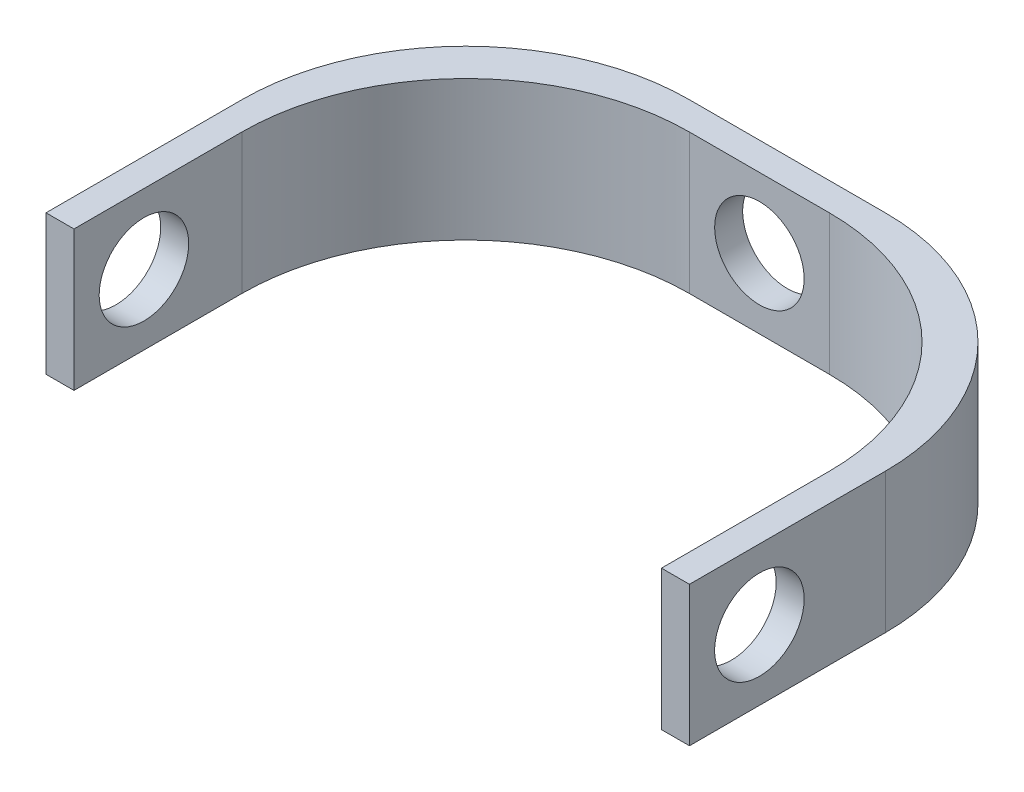
ISO-10303-21;
HEADER;
FILE_DESCRIPTION(('STEP AP214'),'2;1');
FILE_NAME('part.step','',(''),(''),'','','');
FILE_SCHEMA(('AUTOMOTIVE_DESIGN { 1 0 10303 214 1 1 1 1 }'));
ENDSEC;
DATA;
#1=APPLICATION_CONTEXT('core data for automotive mechanical design processes');
#2=APPLICATION_PROTOCOL_DEFINITION('international standard','automotive_design',2000,#1);
#3=PRODUCT_CONTEXT('',#1,'mechanical');
#4=PRODUCT('Part','Part','',(#3));
#5=PRODUCT_RELATED_PRODUCT_CATEGORY('part','',(#4));
#6=PRODUCT_DEFINITION_FORMATION('','',#4);
#7=PRODUCT_DEFINITION_CONTEXT('part definition',#1,'design');
#8=PRODUCT_DEFINITION('design','',#6,#7);
#9=PRODUCT_DEFINITION_SHAPE('','',#8);
#10=(LENGTH_UNIT() NAMED_UNIT(*) SI_UNIT(.MILLI.,.METRE.));
#11=(NAMED_UNIT(*) PLANE_ANGLE_UNIT() SI_UNIT($,.RADIAN.));
#12=(NAMED_UNIT(*) SI_UNIT($,.STERADIAN.) SOLID_ANGLE_UNIT());
#13=UNCERTAINTY_MEASURE_WITH_UNIT(LENGTH_MEASURE(1.E-05),#10,'distance_accuracy_value','');
#14=(GEOMETRIC_REPRESENTATION_CONTEXT(3) GLOBAL_UNCERTAINTY_ASSIGNED_CONTEXT((#13)) GLOBAL_UNIT_ASSIGNED_CONTEXT((#10,
#11,#12)) REPRESENTATION_CONTEXT('',''));
#15=CARTESIAN_POINT('',(0.,0.,0.));
#16=DIRECTION('',(0.,0.,1.));
#17=DIRECTION('',(1.,0.,0.));
#18=AXIS2_PLACEMENT_3D('',#15,#16,#17);
#19=CARTESIAN_POINT('',(0.,5.,0.));
#20=DIRECTION('',(1.,0.,0.));
#21=DIRECTION('',(0.,0.,-1.));
#22=AXIS2_PLACEMENT_3D('',#19,#20,#21);
#23=PLANE('',#22);
#24=CARTESIAN_POINT('',(0.,2.5,-2.5));
#25=DIRECTION('',(1.,0.,0.));
#26=DIRECTION('',(0.,0.,-1.));
#27=AXIS2_PLACEMENT_3D('',#24,#25,#26);
#28=CIRCLE('',#27,1.6);
#29=CARTESIAN_POINT('',(0.,2.5,-4.1));
#30=VERTEX_POINT('',#29);
#31=EDGE_CURVE('E295',#30,#30,#28,.T.);
#32=ORIENTED_EDGE('',*,*,#31,.T.);
#33=EDGE_LOOP('',(#32));
#34=FACE_BOUND('',#33,.T.);
#35=DIRECTION('',(0.,0.,1.));
#36=VECTOR('',#35,1.);
#37=CARTESIAN_POINT('',(0.,5.,0.));
#38=LINE('',#37,#36);
#39=CARTESIAN_POINT('',(0.,5.,-7.));
#40=VERTEX_POINT('',#39);
#41=CARTESIAN_POINT('',(0.,5.,0.));
#42=VERTEX_POINT('',#41);
#43=EDGE_CURVE('E128',#40,#42,#38,.T.);
#44=ORIENTED_EDGE('',*,*,#43,.F.);
#45=DIRECTION('',(0.,-1.,0.));
#46=VECTOR('',#45,1.);
#47=CARTESIAN_POINT('',(0.,5.,-7.));
#48=LINE('',#47,#46);
#49=CARTESIAN_POINT('',(0.,0.,-7.));
#50=VERTEX_POINT('',#49);
#51=EDGE_CURVE('E174',#40,#50,#48,.T.);
#52=ORIENTED_EDGE('',*,*,#51,.T.);
#53=DIRECTION('',(0.,0.,1.));
#54=VECTOR('',#53,1.);
#55=CARTESIAN_POINT('',(0.,0.,0.));
#56=LINE('',#55,#54);
#57=CARTESIAN_POINT('',(0.,0.,0.));
#58=VERTEX_POINT('',#57);
#59=EDGE_CURVE('E155',#50,#58,#56,.T.);
#60=ORIENTED_EDGE('',*,*,#59,.T.);
#61=DIRECTION('',(0.,-1.,0.));
#62=VECTOR('',#61,1.);
#63=CARTESIAN_POINT('',(0.,5.,0.));
#64=LINE('',#63,#62);
#65=EDGE_CURVE('E147',#42,#58,#64,.T.);
#66=ORIENTED_EDGE('',*,*,#65,.F.);
#67=EDGE_LOOP('',(#44,#52,#60,#66));
#68=FACE_BOUND('',#67,.T.);
#69=ADVANCED_FACE('F39',(#34,#68),#23,.F.);
#70=CARTESIAN_POINT('',(0.,5.,0.));
#71=DIRECTION('',(0.,0.,-1.));
#72=DIRECTION('',(-1.,0.,0.));
#73=AXIS2_PLACEMENT_3D('',#70,#71,#72);
#74=PLANE('',#73);
#75=DIRECTION('',(1.,0.,0.));
#76=VECTOR('',#75,1.);
#77=CARTESIAN_POINT('',(0.,0.,0.));
#78=LINE('',#77,#76);
#79=CARTESIAN_POINT('',(1.,0.,0.));
#80=VERTEX_POINT('',#79);
#81=EDGE_CURVE('E245',#58,#80,#78,.T.);
#82=ORIENTED_EDGE('',*,*,#81,.T.);
#83=DIRECTION('',(0.,-1.,0.));
#84=VECTOR('',#83,1.);
#85=CARTESIAN_POINT('',(1.,5.,0.));
#86=LINE('',#85,#84);
#87=CARTESIAN_POINT('',(1.,5.,0.));
#88=VERTEX_POINT('',#87);
#89=EDGE_CURVE('E149',#88,#80,#86,.T.);
#90=ORIENTED_EDGE('',*,*,#89,.F.);
#91=DIRECTION('',(1.,0.,0.));
#92=VECTOR('',#91,1.);
#93=CARTESIAN_POINT('',(0.,5.,0.));
#94=LINE('',#93,#92);
#95=EDGE_CURVE('E133',#42,#88,#94,.T.);
#96=ORIENTED_EDGE('',*,*,#95,.F.);
#97=ORIENTED_EDGE('',*,*,#65,.T.);
#98=EDGE_LOOP('',(#82,#90,#96,#97));
#99=FACE_BOUND('',#98,.T.);
#100=ADVANCED_FACE('F146',(#99),#74,.F.);
#101=CARTESIAN_POINT('',(1.,5.,-14.));
#102=DIRECTION('',(-1.,0.,0.));
#103=DIRECTION('',(0.,0.,1.));
#104=AXIS2_PLACEMENT_3D('',#101,#102,#103);
#105=PLANE('',#104);
#106=CARTESIAN_POINT('',(1.,2.5,-2.5));
#107=DIRECTION('',(-1.,0.,0.));
#108=DIRECTION('',(0.,0.,1.));
#109=AXIS2_PLACEMENT_3D('',#106,#107,#108);
#110=CIRCLE('',#109,1.6);
#111=CARTESIAN_POINT('',(1.,2.5,-0.9));
#112=VERTEX_POINT('',#111);
#113=EDGE_CURVE('E299',#112,#112,#110,.T.);
#114=ORIENTED_EDGE('',*,*,#113,.T.);
#115=EDGE_LOOP('',(#114));
#116=FACE_BOUND('',#115,.T.);
#117=DIRECTION('',(0.,0.,-1.));
#118=VECTOR('',#117,1.);
#119=CARTESIAN_POINT('',(1.,0.,-14.));
#120=LINE('',#119,#118);
#121=CARTESIAN_POINT('',(1.,0.,-6.));
#122=VERTEX_POINT('',#121);
#123=EDGE_CURVE('E249',#80,#122,#120,.T.);
#124=ORIENTED_EDGE('',*,*,#123,.T.);
#125=DIRECTION('',(0.,-1.,0.));
#126=VECTOR('',#125,1.);
#127=CARTESIAN_POINT('',(1.,5.,-6.));
#128=LINE('',#127,#126);
#129=CARTESIAN_POINT('',(1.,5.,-6.));
#130=VERTEX_POINT('',#129);
#131=EDGE_CURVE('E184',#122,#130,#128,.F.);
#132=ORIENTED_EDGE('',*,*,#131,.T.);
#133=DIRECTION('',(0.,0.,-1.));
#134=VECTOR('',#133,1.);
#135=CARTESIAN_POINT('',(1.,5.,-14.));
#136=LINE('',#135,#134);
#137=EDGE_CURVE('E152',#88,#130,#136,.T.);
#138=ORIENTED_EDGE('',*,*,#137,.F.);
#139=ORIENTED_EDGE('',*,*,#89,.T.);
#140=EDGE_LOOP('',(#124,#132,#138,#139));
#141=FACE_BOUND('',#140,.T.);
#142=ADVANCED_FACE('F330',(#116,#141),#105,.F.);
#143=CARTESIAN_POINT('',(1.,5.,-14.));
#144=DIRECTION('',(0.,0.,-1.));
#145=DIRECTION('',(-1.,0.,0.));
#146=AXIS2_PLACEMENT_3D('',#143,#144,#145);
#147=PLANE('',#146);
#148=CARTESIAN_POINT('',(11.5,2.5,-14.));
#149=DIRECTION('',(0.,0.,-1.));
#150=DIRECTION('',(-1.,0.,0.));
#151=AXIS2_PLACEMENT_3D('',#148,#149,#150);
#152=CIRCLE('',#151,1.6);
#153=CARTESIAN_POINT('',(9.9,2.5,-14.));
#154=VERTEX_POINT('',#153);
#155=EDGE_CURVE('E246',#154,#154,#152,.T.);
#156=ORIENTED_EDGE('',*,*,#155,.T.);
#157=EDGE_LOOP('',(#156));
#158=FACE_BOUND('',#157,.T.);
#159=DIRECTION('',(1.,0.,0.));
#160=VECTOR('',#159,1.);
#161=CARTESIAN_POINT('',(1.,5.,-14.));
#162=LINE('',#161,#160);
#163=CARTESIAN_POINT('',(9.,5.,-14.));
#164=VERTEX_POINT('',#163);
#165=CARTESIAN_POINT('',(14.,5.,-14.));
#166=VERTEX_POINT('',#165);
#167=EDGE_CURVE('E277',#164,#166,#162,.T.);
#168=ORIENTED_EDGE('',*,*,#167,.F.);
#169=DIRECTION('',(0.,-1.,0.));
#170=VECTOR('',#169,1.);
#171=CARTESIAN_POINT('',(9.,0.,-14.));
#172=LINE('',#171,#170);
#173=CARTESIAN_POINT('',(9.,0.,-14.));
#174=VERTEX_POINT('',#173);
#175=EDGE_CURVE('E180',#164,#174,#172,.T.);
#176=ORIENTED_EDGE('',*,*,#175,.T.);
#177=DIRECTION('',(1.,0.,0.));
#178=VECTOR('',#177,1.);
#179=CARTESIAN_POINT('',(1.,0.,-14.));
#180=LINE('',#179,#178);
#181=CARTESIAN_POINT('',(14.,0.,-14.));
#182=VERTEX_POINT('',#181);
#183=EDGE_CURVE('E253',#174,#182,#180,.T.);
#184=ORIENTED_EDGE('',*,*,#183,.T.);
#185=DIRECTION('',(0.,-1.,0.));
#186=VECTOR('',#185,1.);
#187=CARTESIAN_POINT('',(14.,5.,-14.));
#188=LINE('',#187,#186);
#189=EDGE_CURVE('E177',#182,#166,#188,.F.);
#190=ORIENTED_EDGE('',*,*,#189,.T.);
#191=EDGE_LOOP('',(#168,#176,#184,#190));
#192=FACE_BOUND('',#191,.T.);
#193=ADVANCED_FACE('F276',(#158,#192),#147,.F.);
#194=CARTESIAN_POINT('',(22.,5.,-14.));
#195=DIRECTION('',(1.,0.,0.));
#196=DIRECTION('',(0.,0.,-1.));
#197=AXIS2_PLACEMENT_3D('',#194,#195,#196);
#198=PLANE('',#197);
#199=CARTESIAN_POINT('',(22.,2.5,-2.5));
#200=DIRECTION('',(1.,0.,0.));
#201=DIRECTION('',(0.,0.,-1.));
#202=AXIS2_PLACEMENT_3D('',#199,#200,#201);
#203=CIRCLE('',#202,1.6);
#204=CARTESIAN_POINT('',(22.,2.5,-4.1));
#205=VERTEX_POINT('',#204);
#206=EDGE_CURVE('E303',#205,#205,#203,.T.);
#207=ORIENTED_EDGE('',*,*,#206,.T.);
#208=EDGE_LOOP('',(#207));
#209=FACE_BOUND('',#208,.T.);
#210=DIRECTION('',(0.,0.,1.));
#211=VECTOR('',#210,1.);
#212=CARTESIAN_POINT('',(22.,5.,-14.));
#213=LINE('',#212,#211);
#214=CARTESIAN_POINT('',(22.,5.,-6.));
#215=VERTEX_POINT('',#214);
#216=CARTESIAN_POINT('',(22.,5.,0.));
#217=VERTEX_POINT('',#216);
#218=EDGE_CURVE('E273',#215,#217,#213,.T.);
#219=ORIENTED_EDGE('',*,*,#218,.F.);
#220=DIRECTION('',(0.,-1.,0.));
#221=VECTOR('',#220,1.);
#222=CARTESIAN_POINT('',(22.,0.,-6.));
#223=LINE('',#222,#221);
#224=CARTESIAN_POINT('',(22.,0.,-6.));
#225=VERTEX_POINT('',#224);
#226=EDGE_CURVE('E187',#215,#225,#223,.T.);
#227=ORIENTED_EDGE('',*,*,#226,.T.);
#228=DIRECTION('',(0.,0.,1.));
#229=VECTOR('',#228,1.);
#230=CARTESIAN_POINT('',(22.,0.,-14.));
#231=LINE('',#230,#229);
#232=CARTESIAN_POINT('',(22.,0.,0.));
#233=VERTEX_POINT('',#232);
#234=EDGE_CURVE('E257',#225,#233,#231,.T.);
#235=ORIENTED_EDGE('',*,*,#234,.T.);
#236=DIRECTION('',(0.,-1.,0.));
#237=VECTOR('',#236,1.);
#238=CARTESIAN_POINT('',(22.,5.,0.));
#239=LINE('',#238,#237);
#240=EDGE_CURVE('E164',#217,#233,#239,.T.);
#241=ORIENTED_EDGE('',*,*,#240,.F.);
#242=EDGE_LOOP('',(#219,#227,#235,#241));
#243=FACE_BOUND('',#242,.T.);
#244=ADVANCED_FACE('F272',(#209,#243),#198,.F.);
#245=CARTESIAN_POINT('',(22.,5.,0.));
#246=DIRECTION('',(0.,0.,-1.));
#247=DIRECTION('',(-1.,0.,0.));
#248=AXIS2_PLACEMENT_3D('',#245,#246,#247);
#249=PLANE('',#248);
#250=DIRECTION('',(1.,0.,0.));
#251=VECTOR('',#250,1.);
#252=CARTESIAN_POINT('',(22.,0.,0.));
#253=LINE('',#252,#251);
#254=CARTESIAN_POINT('',(23.,0.,0.));
#255=VERTEX_POINT('',#254);
#256=EDGE_CURVE('E224',#233,#255,#253,.T.);
#257=ORIENTED_EDGE('',*,*,#256,.T.);
#258=DIRECTION('',(0.,-1.,0.));
#259=VECTOR('',#258,1.);
#260=CARTESIAN_POINT('',(23.,5.,0.));
#261=LINE('',#260,#259);
#262=CARTESIAN_POINT('',(23.,5.,0.));
#263=VERTEX_POINT('',#262);
#264=EDGE_CURVE('E222',#263,#255,#261,.T.);
#265=ORIENTED_EDGE('',*,*,#264,.F.);
#266=DIRECTION('',(1.,0.,0.));
#267=VECTOR('',#266,1.);
#268=CARTESIAN_POINT('',(22.,5.,0.));
#269=LINE('',#268,#267);
#270=EDGE_CURVE('E239',#217,#263,#269,.T.);
#271=ORIENTED_EDGE('',*,*,#270,.F.);
#272=ORIENTED_EDGE('',*,*,#240,.T.);
#273=EDGE_LOOP('',(#257,#265,#271,#272));
#274=FACE_BOUND('',#273,.T.);
#275=ADVANCED_FACE('F268',(#274),#249,.F.);
#276=CARTESIAN_POINT('',(23.,5.,0.));
#277=DIRECTION('',(-1.,0.,0.));
#278=DIRECTION('',(0.,0.,1.));
#279=AXIS2_PLACEMENT_3D('',#276,#277,#278);
#280=PLANE('',#279);
#281=CARTESIAN_POINT('',(23.,2.5,-2.5));
#282=DIRECTION('',(1.,0.,0.));
#283=DIRECTION('',(0.,0.,-1.));
#284=AXIS2_PLACEMENT_3D('',#281,#282,#283);
#285=CIRCLE('',#284,1.6);
#286=CARTESIAN_POINT('',(23.,2.5,-4.1));
#287=VERTEX_POINT('',#286);
#288=EDGE_CURVE('E307',#287,#287,#285,.T.);
#289=ORIENTED_EDGE('',*,*,#288,.F.);
#290=EDGE_LOOP('',(#289));
#291=FACE_BOUND('',#290,.T.);
#292=DIRECTION('',(0.,0.,-1.));
#293=VECTOR('',#292,1.);
#294=CARTESIAN_POINT('',(23.,0.,0.));
#295=LINE('',#294,#293);
#296=CARTESIAN_POINT('',(23.,0.,-7.));
#297=VERTEX_POINT('',#296);
#298=EDGE_CURVE('E212',#255,#297,#295,.T.);
#299=ORIENTED_EDGE('',*,*,#298,.T.);
#300=DIRECTION('',(0.,-1.,0.));
#301=VECTOR('',#300,1.);
#302=CARTESIAN_POINT('',(23.,5.,-7.));
#303=LINE('',#302,#301);
#304=CARTESIAN_POINT('',(23.,5.,-7.));
#305=VERTEX_POINT('',#304);
#306=EDGE_CURVE('E171',#297,#305,#303,.F.);
#307=ORIENTED_EDGE('',*,*,#306,.T.);
#308=DIRECTION('',(0.,0.,-1.));
#309=VECTOR('',#308,1.);
#310=CARTESIAN_POINT('',(23.,5.,0.));
#311=LINE('',#310,#309);
#312=EDGE_CURVE('E230',#263,#305,#311,.T.);
#313=ORIENTED_EDGE('',*,*,#312,.F.);
#314=ORIENTED_EDGE('',*,*,#264,.T.);
#315=EDGE_LOOP('',(#299,#307,#313,#314));
#316=FACE_BOUND('',#315,.T.);
#317=ADVANCED_FACE('F219',(#291,#316),#280,.F.);
#318=CARTESIAN_POINT('',(0.,5.,-15.));
#319=DIRECTION('',(0.,0.,1.));
#320=DIRECTION('',(1.,0.,0.));
#321=AXIS2_PLACEMENT_3D('',#318,#319,#320);
#322=PLANE('',#321);
#323=CARTESIAN_POINT('',(11.5,2.5,-15.));
#324=DIRECTION('',(0.,0.,-1.));
#325=DIRECTION('',(-1.,0.,0.));
#326=AXIS2_PLACEMENT_3D('',#323,#324,#325);
#327=CIRCLE('',#326,1.6);
#328=CARTESIAN_POINT('',(9.9,2.5,-15.));
#329=VERTEX_POINT('',#328);
#330=EDGE_CURVE('E291',#329,#329,#327,.T.);
#331=ORIENTED_EDGE('',*,*,#330,.F.);
#332=EDGE_LOOP('',(#331));
#333=FACE_BOUND('',#332,.T.);
#334=DIRECTION('',(-1.,0.,0.));
#335=VECTOR('',#334,1.);
#336=CARTESIAN_POINT('',(0.,5.,-15.));
#337=LINE('',#336,#335);
#338=CARTESIAN_POINT('',(15.,5.,-15.));
#339=VERTEX_POINT('',#338);
#340=CARTESIAN_POINT('',(8.,5.,-15.));
#341=VERTEX_POINT('',#340);
#342=EDGE_CURVE('E229',#339,#341,#337,.T.);
#343=ORIENTED_EDGE('',*,*,#342,.F.);
#344=DIRECTION('',(0.,-1.,0.));
#345=VECTOR('',#344,1.);
#346=CARTESIAN_POINT('',(15.,5.,-15.));
#347=LINE('',#346,#345);
#348=CARTESIAN_POINT('',(15.,0.,-15.));
#349=VERTEX_POINT('',#348);
#350=EDGE_CURVE('E162',#339,#349,#347,.T.);
#351=ORIENTED_EDGE('',*,*,#350,.T.);
#352=DIRECTION('',(-1.,0.,0.));
#353=VECTOR('',#352,1.);
#354=CARTESIAN_POINT('',(0.,0.,-15.));
#355=LINE('',#354,#353);
#356=CARTESIAN_POINT('',(8.,0.,-15.));
#357=VERTEX_POINT('',#356);
#358=EDGE_CURVE('E142',#349,#357,#355,.T.);
#359=ORIENTED_EDGE('',*,*,#358,.T.);
#360=DIRECTION('',(0.,-1.,0.));
#361=VECTOR('',#360,1.);
#362=CARTESIAN_POINT('',(8.,5.,-15.));
#363=LINE('',#362,#361);
#364=EDGE_CURVE('E158',#357,#341,#363,.F.);
#365=ORIENTED_EDGE('',*,*,#364,.T.);
#366=EDGE_LOOP('',(#343,#351,#359,#365));
#367=FACE_BOUND('',#366,.T.);
#368=ADVANCED_FACE('F232',(#333,#367),#322,.F.);
#369=CARTESIAN_POINT('',(0.,5.,0.));
#370=DIRECTION('',(0.,-1.,0.));
#371=DIRECTION('',(0.,0.,-1.));
#372=AXIS2_PLACEMENT_3D('',#369,#370,#371);
#373=PLANE('',#372);
#374=ORIENTED_EDGE('',*,*,#312,.T.);
#375=CARTESIAN_POINT('',(15.,5.,-7.));
#376=DIRECTION('',(0.,-1.,0.));
#377=DIRECTION('',(0.,0.,-1.));
#378=AXIS2_PLACEMENT_3D('',#375,#376,#377);
#379=CIRCLE('',#378,8.);
#380=EDGE_CURVE('E11',#305,#339,#379,.F.);
#381=ORIENTED_EDGE('',*,*,#380,.T.);
#382=ORIENTED_EDGE('',*,*,#342,.T.);
#383=CARTESIAN_POINT('',(8.,5.,-7.));
#384=DIRECTION('',(0.,-1.,0.));
#385=DIRECTION('',(0.,0.,-1.));
#386=AXIS2_PLACEMENT_3D('',#383,#384,#385);
#387=CIRCLE('',#386,8.);
#388=EDGE_CURVE('E48',#341,#40,#387,.F.);
#389=ORIENTED_EDGE('',*,*,#388,.T.);
#390=ORIENTED_EDGE('',*,*,#43,.T.);
#391=ORIENTED_EDGE('',*,*,#95,.T.);
#392=ORIENTED_EDGE('',*,*,#137,.T.);
#393=CARTESIAN_POINT('',(9.,5.,-6.));
#394=DIRECTION('',(0.,-1.,0.));
#395=DIRECTION('',(0.,0.,-1.));
#396=AXIS2_PLACEMENT_3D('',#393,#394,#395);
#397=CIRCLE('',#396,8.);
#398=EDGE_CURVE('E193',#130,#164,#397,.T.);
#399=ORIENTED_EDGE('',*,*,#398,.T.);
#400=ORIENTED_EDGE('',*,*,#167,.T.);
#401=CARTESIAN_POINT('',(14.,5.,-6.));
#402=DIRECTION('',(0.,-1.,0.));
#403=DIRECTION('',(0.,0.,-1.));
#404=AXIS2_PLACEMENT_3D('',#401,#402,#403);
#405=CIRCLE('',#404,8.);
#406=EDGE_CURVE('E55',#166,#215,#405,.T.);
#407=ORIENTED_EDGE('',*,*,#406,.T.);
#408=ORIENTED_EDGE('',*,*,#218,.T.);
#409=ORIENTED_EDGE('',*,*,#270,.T.);
#410=EDGE_LOOP('',(#374,#381,#382,#389,#390,#391,#392,#399,#400,#407,#408,#409));
#411=FACE_BOUND('',#410,.T.);
#412=ADVANCED_FACE('F131',(#411),#373,.F.);
#413=CARTESIAN_POINT('',(0.,0.,0.));
#414=DIRECTION('',(0.,-1.,0.));
#415=DIRECTION('',(0.,0.,-1.));
#416=AXIS2_PLACEMENT_3D('',#413,#414,#415);
#417=PLANE('',#416);
#418=ORIENTED_EDGE('',*,*,#358,.F.);
#419=CARTESIAN_POINT('',(15.,0.,-7.));
#420=DIRECTION('',(0.,-1.,0.));
#421=DIRECTION('',(0.,0.,-1.));
#422=AXIS2_PLACEMENT_3D('',#419,#420,#421);
#423=CIRCLE('',#422,8.);
#424=EDGE_CURVE('E203',#349,#297,#423,.T.);
#425=ORIENTED_EDGE('',*,*,#424,.T.);
#426=ORIENTED_EDGE('',*,*,#298,.F.);
#427=ORIENTED_EDGE('',*,*,#256,.F.);
#428=ORIENTED_EDGE('',*,*,#234,.F.);
#429=CARTESIAN_POINT('',(14.,0.,-6.));
#430=DIRECTION('',(0.,-1.,0.));
#431=DIRECTION('',(0.,0.,-1.));
#432=AXIS2_PLACEMENT_3D('',#429,#430,#431);
#433=CIRCLE('',#432,8.);
#434=EDGE_CURVE('E63',#225,#182,#433,.F.);
#435=ORIENTED_EDGE('',*,*,#434,.T.);
#436=ORIENTED_EDGE('',*,*,#183,.F.);
#437=CARTESIAN_POINT('',(9.,0.,-6.));
#438=DIRECTION('',(0.,-1.,0.));
#439=DIRECTION('',(0.,0.,-1.));
#440=AXIS2_PLACEMENT_3D('',#437,#438,#439);
#441=CIRCLE('',#440,8.);
#442=EDGE_CURVE('E190',#174,#122,#441,.F.);
#443=ORIENTED_EDGE('',*,*,#442,.T.);
#444=ORIENTED_EDGE('',*,*,#123,.F.);
#445=ORIENTED_EDGE('',*,*,#81,.F.);
#446=ORIENTED_EDGE('',*,*,#59,.F.);
#447=CARTESIAN_POINT('',(8.,0.,-7.));
#448=DIRECTION('',(0.,-1.,0.));
#449=DIRECTION('',(0.,0.,-1.));
#450=AXIS2_PLACEMENT_3D('',#447,#448,#449);
#451=CIRCLE('',#450,8.);
#452=EDGE_CURVE('E200',#50,#357,#451,.T.);
#453=ORIENTED_EDGE('',*,*,#452,.T.);
#454=EDGE_LOOP('',(#418,#425,#426,#427,#428,#435,#436,#443,#444,#445,#446,#453));
#455=FACE_BOUND('',#454,.T.);
#456=ADVANCED_FACE('F210',(#455),#417,.T.);
#457=CARTESIAN_POINT('',(11.5,2.5,-10.));
#458=DIRECTION('',(0.,0.,-1.));
#459=DIRECTION('',(-1.,0.,0.));
#460=AXIS2_PLACEMENT_3D('',#457,#458,#459);
#461=CYLINDRICAL_SURFACE('',#460,1.6);
#462=ORIENTED_EDGE('',*,*,#330,.T.);
#463=EDGE_LOOP('',(#462));
#464=FACE_BOUND('',#463,.T.);
#465=ORIENTED_EDGE('',*,*,#155,.F.);
#466=EDGE_LOOP('',(#465));
#467=FACE_BOUND('',#466,.T.);
#468=ADVANCED_FACE('F363',(#464,#467),#461,.F.);
#469=CARTESIAN_POINT('',(-4.,2.5,-2.5));
#470=DIRECTION('',(1.,0.,0.));
#471=DIRECTION('',(0.,0.,-1.));
#472=AXIS2_PLACEMENT_3D('',#469,#470,#471);
#473=CYLINDRICAL_SURFACE('',#472,1.6);
#474=ORIENTED_EDGE('',*,*,#288,.T.);
#475=EDGE_LOOP('',(#474));
#476=FACE_BOUND('',#475,.T.);
#477=ORIENTED_EDGE('',*,*,#206,.F.);
#478=EDGE_LOOP('',(#477));
#479=FACE_BOUND('',#478,.T.);
#480=ADVANCED_FACE('F312',(#476,#479),#473,.F.);
#481=ORIENTED_EDGE('',*,*,#113,.F.);
#482=EDGE_LOOP('',(#481));
#483=FACE_BOUND('',#482,.T.);
#484=ORIENTED_EDGE('',*,*,#31,.F.);
#485=EDGE_LOOP('',(#484));
#486=FACE_BOUND('',#485,.T.);
#487=ADVANCED_FACE('F337',(#483,#486),#473,.F.);
#488=CARTESIAN_POINT('',(15.,5.,-7.));
#489=DIRECTION('',(0.,-1.,0.));
#490=DIRECTION('',(0.,0.,-1.));
#491=AXIS2_PLACEMENT_3D('',#488,#489,#490);
#492=CYLINDRICAL_SURFACE('',#491,8.);
#493=ORIENTED_EDGE('',*,*,#380,.F.);
#494=ORIENTED_EDGE('',*,*,#306,.F.);
#495=ORIENTED_EDGE('',*,*,#424,.F.);
#496=ORIENTED_EDGE('',*,*,#350,.F.);
#497=EDGE_LOOP('',(#493,#494,#495,#496));
#498=FACE_BOUND('',#497,.T.);
#499=ADVANCED_FACE('F227',(#498),#492,.T.);
#500=CARTESIAN_POINT('',(8.,5.,-7.));
#501=DIRECTION('',(0.,-1.,0.));
#502=DIRECTION('',(0.,0.,-1.));
#503=AXIS2_PLACEMENT_3D('',#500,#501,#502);
#504=CYLINDRICAL_SURFACE('',#503,8.);
#505=ORIENTED_EDGE('',*,*,#388,.F.);
#506=ORIENTED_EDGE('',*,*,#364,.F.);
#507=ORIENTED_EDGE('',*,*,#452,.F.);
#508=ORIENTED_EDGE('',*,*,#51,.F.);
#509=EDGE_LOOP('',(#505,#506,#507,#508));
#510=FACE_BOUND('',#509,.T.);
#511=ADVANCED_FACE('F336',(#510),#504,.T.);
#512=CARTESIAN_POINT('',(9.,5.,-6.));
#513=DIRECTION('',(0.,1.,0.));
#514=DIRECTION('',(0.,0.,1.));
#515=AXIS2_PLACEMENT_3D('',#512,#513,#514);
#516=CYLINDRICAL_SURFACE('',#515,8.);
#517=ORIENTED_EDGE('',*,*,#398,.F.);
#518=ORIENTED_EDGE('',*,*,#131,.F.);
#519=ORIENTED_EDGE('',*,*,#442,.F.);
#520=ORIENTED_EDGE('',*,*,#175,.F.);
#521=EDGE_LOOP('',(#517,#518,#519,#520));
#522=FACE_BOUND('',#521,.T.);
#523=ADVANCED_FACE('F339',(#522),#516,.F.);
#524=CARTESIAN_POINT('',(14.,5.,-6.));
#525=DIRECTION('',(0.,1.,0.));
#526=DIRECTION('',(0.,0.,1.));
#527=AXIS2_PLACEMENT_3D('',#524,#525,#526);
#528=CYLINDRICAL_SURFACE('',#527,8.);
#529=ORIENTED_EDGE('',*,*,#406,.F.);
#530=ORIENTED_EDGE('',*,*,#189,.F.);
#531=ORIENTED_EDGE('',*,*,#434,.F.);
#532=ORIENTED_EDGE('',*,*,#226,.F.);
#533=EDGE_LOOP('',(#529,#530,#531,#532));
#534=FACE_BOUND('',#533,.T.);
#535=ADVANCED_FACE('F41',(#534),#528,.F.);
#536=CLOSED_SHELL('',(#69,#100,#142,#193,#244,#275,#317,#368,#412,#456,#468,#480,#487,#499,#511,
#523,#535));
#537=MANIFOLD_SOLID_BREP('B2',#536);
#538=ADVANCED_BREP_SHAPE_REPRESENTATION('',(#18,#537),#14);
#539=SHAPE_DEFINITION_REPRESENTATION(#9,#538);
ENDSEC;
END-ISO-10303-21;
